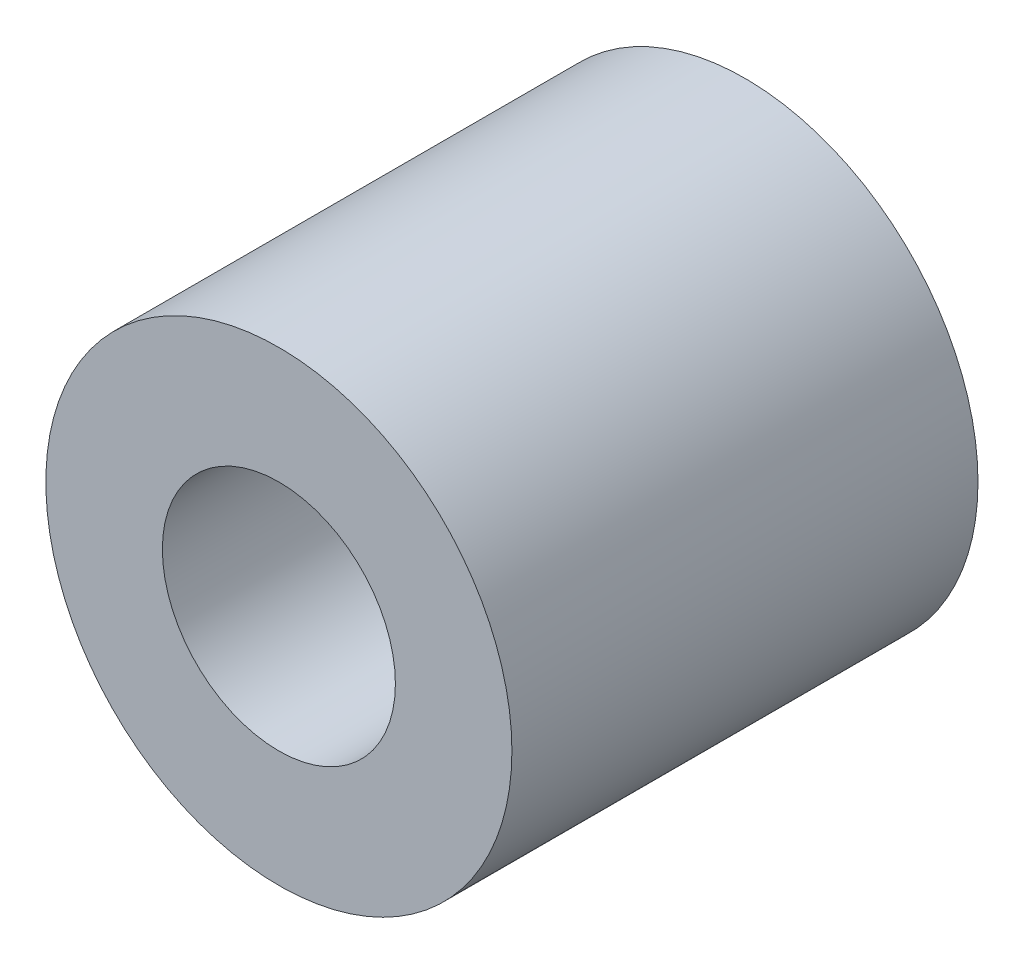
ISO-10303-21;
HEADER;
FILE_DESCRIPTION(('STEP AP214'),'2;1');
FILE_NAME('part.step','',(''),(''),'','','');
FILE_SCHEMA(('AUTOMOTIVE_DESIGN { 1 0 10303 214 1 1 1 1 }'));
ENDSEC;
DATA;
#1=APPLICATION_CONTEXT('core data for automotive mechanical design processes');
#2=APPLICATION_PROTOCOL_DEFINITION('international standard','automotive_design',2000,#1);
#3=PRODUCT_CONTEXT('',#1,'mechanical');
#4=PRODUCT('Part','Part','',(#3));
#5=PRODUCT_RELATED_PRODUCT_CATEGORY('part','',(#4));
#6=PRODUCT_DEFINITION_FORMATION('','',#4);
#7=PRODUCT_DEFINITION_CONTEXT('part definition',#1,'design');
#8=PRODUCT_DEFINITION('design','',#6,#7);
#9=PRODUCT_DEFINITION_SHAPE('','',#8);
#10=(LENGTH_UNIT() NAMED_UNIT(*) SI_UNIT(.MILLI.,.METRE.));
#11=(NAMED_UNIT(*) PLANE_ANGLE_UNIT() SI_UNIT($,.RADIAN.));
#12=(NAMED_UNIT(*) SI_UNIT($,.STERADIAN.) SOLID_ANGLE_UNIT());
#13=UNCERTAINTY_MEASURE_WITH_UNIT(LENGTH_MEASURE(1.E-05),#10,'distance_accuracy_value','');
#14=(GEOMETRIC_REPRESENTATION_CONTEXT(3) GLOBAL_UNCERTAINTY_ASSIGNED_CONTEXT((#13)) GLOBAL_UNIT_ASSIGNED_CONTEXT((#10,
#11,#12)) REPRESENTATION_CONTEXT('',''));
#15=CARTESIAN_POINT('',(0.,0.,0.));
#16=DIRECTION('',(0.,0.,1.));
#17=DIRECTION('',(1.,0.,0.));
#18=AXIS2_PLACEMENT_3D('',#15,#16,#17);
#19=CARTESIAN_POINT('',(0.,0.,16.));
#20=DIRECTION('',(0.,0.,1.));
#21=DIRECTION('',(1.,0.,0.));
#22=AXIS2_PLACEMENT_3D('',#19,#20,#21);
#23=PLANE('',#22);
#24=CARTESIAN_POINT('',(0.,0.,16.));
#25=DIRECTION('',(0.,0.,1.));
#26=DIRECTION('',(1.,0.,0.));
#27=AXIS2_PLACEMENT_3D('',#24,#25,#26);
#28=CIRCLE('',#27,8.);
#29=CARTESIAN_POINT('',(8.,0.,16.));
#30=VERTEX_POINT('',#29);
#31=EDGE_CURVE('E10',#30,#30,#28,.T.);
#32=ORIENTED_EDGE('',*,*,#31,.T.);
#33=EDGE_LOOP('',(#32));
#34=FACE_BOUND('',#33,.T.);
#35=CARTESIAN_POINT('',(0.,0.,16.));
#36=DIRECTION('',(0.,0.,1.));
#37=DIRECTION('',(1.,0.,0.));
#38=AXIS2_PLACEMENT_3D('',#35,#36,#37);
#39=CIRCLE('',#38,4.);
#40=CARTESIAN_POINT('',(4.,0.,16.));
#41=VERTEX_POINT('',#40);
#42=EDGE_CURVE('E46',#41,#41,#39,.T.);
#43=ORIENTED_EDGE('',*,*,#42,.F.);
#44=EDGE_LOOP('',(#43));
#45=FACE_BOUND('',#44,.T.);
#46=ADVANCED_FACE('F35',(#34,#45),#23,.T.);
#47=CARTESIAN_POINT('',(0.,0.,0.));
#48=DIRECTION('',(0.,0.,1.));
#49=DIRECTION('',(1.,0.,0.));
#50=AXIS2_PLACEMENT_3D('',#47,#48,#49);
#51=PLANE('',#50);
#52=CARTESIAN_POINT('',(0.,0.,0.));
#53=DIRECTION('',(0.,0.,1.));
#54=DIRECTION('',(1.,0.,0.));
#55=AXIS2_PLACEMENT_3D('',#52,#53,#54);
#56=CIRCLE('',#55,8.);
#57=CARTESIAN_POINT('',(8.,0.,0.));
#58=VERTEX_POINT('',#57);
#59=EDGE_CURVE('E39',#58,#58,#56,.T.);
#60=ORIENTED_EDGE('',*,*,#59,.F.);
#61=EDGE_LOOP('',(#60));
#62=FACE_BOUND('',#61,.T.);
#63=CARTESIAN_POINT('',(0.,0.,0.));
#64=DIRECTION('',(0.,0.,1.));
#65=DIRECTION('',(1.,0.,0.));
#66=AXIS2_PLACEMENT_3D('',#63,#64,#65);
#67=CIRCLE('',#66,4.);
#68=CARTESIAN_POINT('',(4.,0.,0.));
#69=VERTEX_POINT('',#68);
#70=EDGE_CURVE('E48',#69,#69,#67,.T.);
#71=ORIENTED_EDGE('',*,*,#70,.T.);
#72=EDGE_LOOP('',(#71));
#73=FACE_BOUND('',#72,.T.);
#74=ADVANCED_FACE('F58',(#62,#73),#51,.F.);
#75=CARTESIAN_POINT('',(0.,0.,16.));
#76=DIRECTION('',(0.,0.,-1.));
#77=DIRECTION('',(-1.,0.,0.));
#78=AXIS2_PLACEMENT_3D('',#75,#76,#77);
#79=CYLINDRICAL_SURFACE('',#78,8.);
#80=ORIENTED_EDGE('',*,*,#31,.F.);
#81=EDGE_LOOP('',(#80));
#82=FACE_BOUND('',#81,.T.);
#83=ORIENTED_EDGE('',*,*,#59,.T.);
#84=EDGE_LOOP('',(#83));
#85=FACE_BOUND('',#84,.T.);
#86=ADVANCED_FACE('F37',(#82,#85),#79,.T.);
#87=CARTESIAN_POINT('',(0.,0.,16.));
#88=DIRECTION('',(0.,0.,-1.));
#89=DIRECTION('',(-1.,0.,0.));
#90=AXIS2_PLACEMENT_3D('',#87,#88,#89);
#91=CYLINDRICAL_SURFACE('',#90,4.);
#92=ORIENTED_EDGE('',*,*,#42,.T.);
#93=EDGE_LOOP('',(#92));
#94=FACE_BOUND('',#93,.T.);
#95=ORIENTED_EDGE('',*,*,#70,.F.);
#96=EDGE_LOOP('',(#95));
#97=FACE_BOUND('',#96,.T.);
#98=ADVANCED_FACE('F54',(#94,#97),#91,.F.);
#99=CLOSED_SHELL('',(#46,#74,#86,#98));
#100=MANIFOLD_SOLID_BREP('B2',#99);
#101=ADVANCED_BREP_SHAPE_REPRESENTATION('',(#18,#100),#14);
#102=SHAPE_DEFINITION_REPRESENTATION(#9,#101);
ENDSEC;
END-ISO-10303-21;
